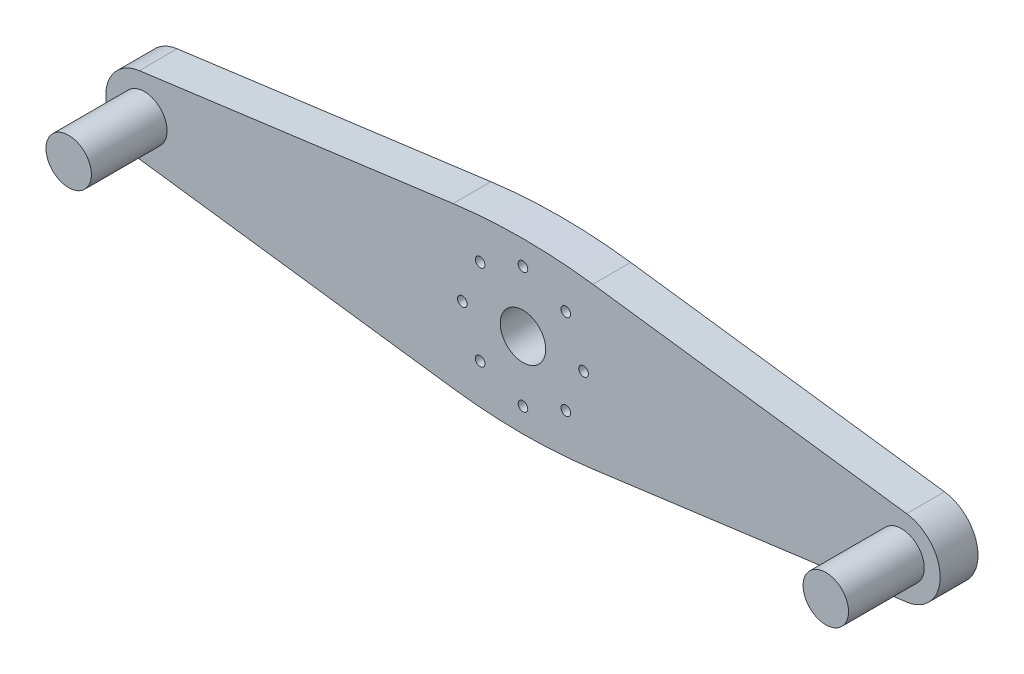
ISO-10303-21;
HEADER;
FILE_DESCRIPTION(('STEP AP214'),'2;1');
FILE_NAME('part.step','',(''),(''),'','','');
FILE_SCHEMA(('AUTOMOTIVE_DESIGN { 1 0 10303 214 1 1 1 1 }'));
ENDSEC;
DATA;
#1=APPLICATION_CONTEXT('core data for automotive mechanical design processes');
#2=APPLICATION_PROTOCOL_DEFINITION('international standard','automotive_design',2000,#1);
#3=PRODUCT_CONTEXT('',#1,'mechanical');
#4=PRODUCT('Part','Part','',(#3));
#5=PRODUCT_RELATED_PRODUCT_CATEGORY('part','',(#4));
#6=PRODUCT_DEFINITION_FORMATION('','',#4);
#7=PRODUCT_DEFINITION_CONTEXT('part definition',#1,'design');
#8=PRODUCT_DEFINITION('design','',#6,#7);
#9=PRODUCT_DEFINITION_SHAPE('','',#8);
#10=(LENGTH_UNIT() NAMED_UNIT(*) SI_UNIT(.MILLI.,.METRE.));
#11=(NAMED_UNIT(*) PLANE_ANGLE_UNIT() SI_UNIT($,.RADIAN.));
#12=(NAMED_UNIT(*) SI_UNIT($,.STERADIAN.) SOLID_ANGLE_UNIT());
#13=UNCERTAINTY_MEASURE_WITH_UNIT(LENGTH_MEASURE(1.E-05),#10,'distance_accuracy_value','');
#14=(GEOMETRIC_REPRESENTATION_CONTEXT(3) GLOBAL_UNCERTAINTY_ASSIGNED_CONTEXT((#13)) GLOBAL_UNIT_ASSIGNED_CONTEXT((#10,
#11,#12)) REPRESENTATION_CONTEXT('',''));
#15=CARTESIAN_POINT('',(0.,0.,0.));
#16=DIRECTION('',(0.,0.,1.));
#17=DIRECTION('',(1.,0.,0.));
#18=AXIS2_PLACEMENT_3D('',#15,#16,#17);
#19=CARTESIAN_POINT('',(50.,0.,5.));
#20=DIRECTION('',(0.,0.,-1.));
#21=DIRECTION('',(-1.,0.,0.));
#22=AXIS2_PLACEMENT_3D('',#19,#20,#21);
#23=PLANE('',#22);
#24=CARTESIAN_POINT('',(50.,0.,5.));
#25=DIRECTION('',(0.,0.,1.));
#26=DIRECTION('',(-1.,0.,0.));
#27=AXIS2_PLACEMENT_3D('',#24,#25,#26);
#28=CIRCLE('',#27,5.10024633771241);
#29=CARTESIAN_POINT('',(50.6728763500851,-5.05566515137672,5.));
#30=VERTEX_POINT('',#29);
#31=CARTESIAN_POINT('',(50.6728763500851,5.05566515137672,5.));
#32=VERTEX_POINT('',#31);
#33=EDGE_CURVE('E154',#30,#32,#28,.T.);
#34=ORIENTED_EDGE('',*,*,#33,.T.);
#35=DIRECTION('',(-0.991259013117456,0.131930166805804,0.));
#36=VECTOR('',#35,1.);
#37=CARTESIAN_POINT('',(50.6728763500851,5.05566515137672,5.));
#38=LINE('',#37,#36);
#39=CARTESIAN_POINT('',(9.2351116764065,10.5707637614413,5.));
#40=VERTEX_POINT('',#39);
#41=EDGE_CURVE('E102',#32,#40,#38,.T.);
#42=ORIENTED_EDGE('',*,*,#41,.T.);
#43=CARTESIAN_POINT('',(0.,-58.8173671567806,5.));
#44=DIRECTION('',(0.,0.,1.));
#45=DIRECTION('',(-1.,0.,0.));
#46=AXIS2_PLACEMENT_3D('',#43,#44,#45);
#47=CIRCLE('',#46,70.);
#48=CARTESIAN_POINT('',(-9.23511167640649,10.5707637614413,5.));
#49=VERTEX_POINT('',#48);
#50=EDGE_CURVE('E169',#40,#49,#47,.T.);
#51=ORIENTED_EDGE('',*,*,#50,.T.);
#52=DIRECTION('',(-0.991259013117456,-0.131930166805804,0.));
#53=VECTOR('',#52,1.);
#54=CARTESIAN_POINT('',(-50.6728763500851,5.05566515137672,5.));
#55=LINE('',#54,#53);
#56=CARTESIAN_POINT('',(-50.6728763500851,5.05566515137672,5.));
#57=VERTEX_POINT('',#56);
#58=EDGE_CURVE('E182',#49,#57,#55,.T.);
#59=ORIENTED_EDGE('',*,*,#58,.T.);
#60=CARTESIAN_POINT('',(-50.,0.,5.));
#61=DIRECTION('',(0.,0.,1.));
#62=DIRECTION('',(1.,0.,0.));
#63=AXIS2_PLACEMENT_3D('',#60,#61,#62);
#64=CIRCLE('',#63,5.10024633771241);
#65=CARTESIAN_POINT('',(-50.6728763500851,-5.05566515137672,5.));
#66=VERTEX_POINT('',#65);
#67=EDGE_CURVE('E121',#57,#66,#64,.T.);
#68=ORIENTED_EDGE('',*,*,#67,.T.);
#69=DIRECTION('',(0.991259013117456,-0.131930166805804,0.));
#70=VECTOR('',#69,1.);
#71=CARTESIAN_POINT('',(-50.6728763500851,-5.05566515137672,5.));
#72=LINE('',#71,#70);
#73=CARTESIAN_POINT('',(-9.23511167640653,-10.5707637614413,5.));
#74=VERTEX_POINT('',#73);
#75=EDGE_CURVE('E115',#66,#74,#72,.T.);
#76=ORIENTED_EDGE('',*,*,#75,.T.);
#77=CARTESIAN_POINT('',(0.,58.8173671567806,5.));
#78=DIRECTION('',(0.,0.,1.));
#79=DIRECTION('',(1.,0.,0.));
#80=AXIS2_PLACEMENT_3D('',#77,#78,#79);
#81=CIRCLE('',#80,70.);
#82=CARTESIAN_POINT('',(9.23511167640649,-10.5707637614413,5.));
#83=VERTEX_POINT('',#82);
#84=EDGE_CURVE('E119',#74,#83,#81,.T.);
#85=ORIENTED_EDGE('',*,*,#84,.T.);
#86=DIRECTION('',(0.991259013117456,0.131930166805804,0.));
#87=VECTOR('',#86,1.);
#88=CARTESIAN_POINT('',(50.6728763500851,-5.05566515137672,5.));
#89=LINE('',#88,#87);
#90=EDGE_CURVE('E59',#83,#30,#89,.T.);
#91=ORIENTED_EDGE('',*,*,#90,.T.);
#92=EDGE_LOOP('',(#34,#42,#51,#59,#68,#76,#85,#91));
#93=FACE_BOUND('',#92,.T.);
#94=CARTESIAN_POINT('',(0.,0.,5.));
#95=DIRECTION('',(0.,0.,1.));
#96=DIRECTION('',(1.,0.,0.));
#97=AXIS2_PLACEMENT_3D('',#94,#95,#96);
#98=CIRCLE('',#97,3.);
#99=CARTESIAN_POINT('',(3.,0.,5.));
#100=VERTEX_POINT('',#99);
#101=EDGE_CURVE('E143',#100,#100,#98,.T.);
#102=ORIENTED_EDGE('',*,*,#101,.F.);
#103=EDGE_LOOP('',(#102));
#104=FACE_BOUND('',#103,.T.);
#105=CARTESIAN_POINT('',(-8.,0.,5.));
#106=DIRECTION('',(0.,0.,1.));
#107=DIRECTION('',(1.,0.,0.));
#108=AXIS2_PLACEMENT_3D('',#105,#106,#107);
#109=CIRCLE('',#108,0.635000000000001);
#110=CARTESIAN_POINT('',(-7.365,0.,5.));
#111=VERTEX_POINT('',#110);
#112=EDGE_CURVE('E191',#111,#111,#109,.T.);
#113=ORIENTED_EDGE('',*,*,#112,.F.);
#114=EDGE_LOOP('',(#113));
#115=FACE_BOUND('',#114,.T.);
#116=CARTESIAN_POINT('',(-50.,0.,5.));
#117=DIRECTION('',(0.,0.,1.));
#118=DIRECTION('',(1.,0.,0.));
#119=AXIS2_PLACEMENT_3D('',#116,#117,#118);
#120=CIRCLE('',#119,3.);
#121=CARTESIAN_POINT('',(-47.,0.,5.));
#122=VERTEX_POINT('',#121);
#123=EDGE_CURVE('E197',#122,#122,#120,.T.);
#124=ORIENTED_EDGE('',*,*,#123,.F.);
#125=EDGE_LOOP('',(#124));
#126=FACE_BOUND('',#125,.T.);
#127=CARTESIAN_POINT('',(-5.65685424949237,5.65685424949239,5.));
#128=DIRECTION('',(0.,0.,1.));
#129=DIRECTION('',(1.,0.,0.));
#130=AXIS2_PLACEMENT_3D('',#127,#128,#129);
#131=CIRCLE('',#130,0.635000000000001);
#132=CARTESIAN_POINT('',(-5.02185424949237,5.65685424949239,5.));
#133=VERTEX_POINT('',#132);
#134=EDGE_CURVE('E202',#133,#133,#131,.T.);
#135=ORIENTED_EDGE('',*,*,#134,.F.);
#136=EDGE_LOOP('',(#135));
#137=FACE_BOUND('',#136,.T.);
#138=CARTESIAN_POINT('',(0.,8.,5.));
#139=DIRECTION('',(0.,0.,1.));
#140=DIRECTION('',(1.,0.,0.));
#141=AXIS2_PLACEMENT_3D('',#138,#139,#140);
#142=CIRCLE('',#141,0.635000000000001);
#143=CARTESIAN_POINT('',(0.63500000000003,8.,5.));
#144=VERTEX_POINT('',#143);
#145=EDGE_CURVE('E206',#144,#144,#142,.T.);
#146=ORIENTED_EDGE('',*,*,#145,.F.);
#147=EDGE_LOOP('',(#146));
#148=FACE_BOUND('',#147,.T.);
#149=CARTESIAN_POINT('',(50.,0.,5.));
#150=DIRECTION('',(0.,0.,1.));
#151=DIRECTION('',(-1.,0.,0.));
#152=AXIS2_PLACEMENT_3D('',#149,#150,#151);
#153=CIRCLE('',#152,3.);
#154=CARTESIAN_POINT('',(47.,0.,5.));
#155=VERTEX_POINT('',#154);
#156=EDGE_CURVE('E212',#155,#155,#153,.T.);
#157=ORIENTED_EDGE('',*,*,#156,.F.);
#158=EDGE_LOOP('',(#157));
#159=FACE_BOUND('',#158,.T.);
#160=CARTESIAN_POINT('',(5.65685424949241,5.65685424949235,5.));
#161=DIRECTION('',(0.,0.,1.));
#162=DIRECTION('',(1.,0.,0.));
#163=AXIS2_PLACEMENT_3D('',#160,#161,#162);
#164=CIRCLE('',#163,0.635);
#165=CARTESIAN_POINT('',(6.29185424949241,5.65685424949235,5.));
#166=VERTEX_POINT('',#165);
#167=EDGE_CURVE('E217',#166,#166,#164,.T.);
#168=ORIENTED_EDGE('',*,*,#167,.F.);
#169=EDGE_LOOP('',(#168));
#170=FACE_BOUND('',#169,.T.);
#171=CARTESIAN_POINT('',(8.,0.,5.));
#172=DIRECTION('',(0.,0.,1.));
#173=DIRECTION('',(1.,0.,0.));
#174=AXIS2_PLACEMENT_3D('',#171,#172,#173);
#175=CIRCLE('',#174,0.635);
#176=CARTESIAN_POINT('',(8.635,0.,5.));
#177=VERTEX_POINT('',#176);
#178=EDGE_CURVE('E221',#177,#177,#175,.T.);
#179=ORIENTED_EDGE('',*,*,#178,.F.);
#180=EDGE_LOOP('',(#179));
#181=FACE_BOUND('',#180,.T.);
#182=CARTESIAN_POINT('',(5.65685424949233,-5.65685424949243,5.));
#183=DIRECTION('',(0.,0.,1.));
#184=DIRECTION('',(1.,0.,0.));
#185=AXIS2_PLACEMENT_3D('',#182,#183,#184);
#186=CIRCLE('',#185,0.635000000000001);
#187=CARTESIAN_POINT('',(6.29185424949233,-5.65685424949243,5.));
#188=VERTEX_POINT('',#187);
#189=EDGE_CURVE('E227',#188,#188,#186,.T.);
#190=ORIENTED_EDGE('',*,*,#189,.F.);
#191=EDGE_LOOP('',(#190));
#192=FACE_BOUND('',#191,.T.);
#193=CARTESIAN_POINT('',(0.,-8.,5.));
#194=DIRECTION('',(0.,0.,1.));
#195=DIRECTION('',(1.,0.,0.));
#196=AXIS2_PLACEMENT_3D('',#193,#194,#195);
#197=CIRCLE('',#196,0.635);
#198=CARTESIAN_POINT('',(0.634999999999915,-8.,5.));
#199=VERTEX_POINT('',#198);
#200=EDGE_CURVE('E233',#199,#199,#197,.T.);
#201=ORIENTED_EDGE('',*,*,#200,.F.);
#202=EDGE_LOOP('',(#201));
#203=FACE_BOUND('',#202,.T.);
#204=CARTESIAN_POINT('',(-5.65685424949245,-5.65685424949231,5.));
#205=DIRECTION('',(0.,0.,1.));
#206=DIRECTION('',(1.,0.,0.));
#207=AXIS2_PLACEMENT_3D('',#204,#205,#206);
#208=CIRCLE('',#207,0.635);
#209=CARTESIAN_POINT('',(-5.02185424949245,-5.65685424949231,5.));
#210=VERTEX_POINT('',#209);
#211=EDGE_CURVE('E239',#210,#210,#208,.T.);
#212=ORIENTED_EDGE('',*,*,#211,.F.);
#213=EDGE_LOOP('',(#212));
#214=FACE_BOUND('',#213,.T.);
#215=ADVANCED_FACE('F42',(#93,#104,#115,#126,#137,#148,#159,#170,#181,#192,#203,#214),#23,.F.);
#216=CARTESIAN_POINT('',(50.,0.,0.));
#217=DIRECTION('',(0.,0.,-1.));
#218=DIRECTION('',(-1.,0.,0.));
#219=AXIS2_PLACEMENT_3D('',#216,#217,#218);
#220=PLANE('',#219);
#221=CARTESIAN_POINT('',(0.,-8.,0.));
#222=DIRECTION('',(0.,0.,1.));
#223=DIRECTION('',(1.,0.,0.));
#224=AXIS2_PLACEMENT_3D('',#221,#222,#223);
#225=CIRCLE('',#224,0.635);
#226=CARTESIAN_POINT('',(0.634999999999915,-8.,0.));
#227=VERTEX_POINT('',#226);
#228=EDGE_CURVE('E236',#227,#227,#225,.T.);
#229=ORIENTED_EDGE('',*,*,#228,.T.);
#230=EDGE_LOOP('',(#229));
#231=FACE_BOUND('',#230,.T.);
#232=CARTESIAN_POINT('',(8.,0.,0.));
#233=DIRECTION('',(0.,0.,1.));
#234=DIRECTION('',(1.,0.,0.));
#235=AXIS2_PLACEMENT_3D('',#232,#233,#234);
#236=CIRCLE('',#235,0.635);
#237=CARTESIAN_POINT('',(8.635,0.,0.));
#238=VERTEX_POINT('',#237);
#239=EDGE_CURVE('E224',#238,#238,#236,.T.);
#240=ORIENTED_EDGE('',*,*,#239,.T.);
#241=EDGE_LOOP('',(#240));
#242=FACE_BOUND('',#241,.T.);
#243=CARTESIAN_POINT('',(-5.65685424949237,5.65685424949239,0.));
#244=DIRECTION('',(0.,0.,1.));
#245=DIRECTION('',(1.,0.,0.));
#246=AXIS2_PLACEMENT_3D('',#243,#244,#245);
#247=CIRCLE('',#246,0.635000000000001);
#248=CARTESIAN_POINT('',(-5.02185424949237,5.65685424949239,0.));
#249=VERTEX_POINT('',#248);
#250=EDGE_CURVE('E203',#249,#249,#247,.T.);
#251=ORIENTED_EDGE('',*,*,#250,.T.);
#252=EDGE_LOOP('',(#251));
#253=FACE_BOUND('',#252,.T.);
#254=CARTESIAN_POINT('',(-8.,0.,0.));
#255=DIRECTION('',(0.,0.,1.));
#256=DIRECTION('',(1.,0.,0.));
#257=AXIS2_PLACEMENT_3D('',#254,#255,#256);
#258=CIRCLE('',#257,0.635000000000001);
#259=CARTESIAN_POINT('',(-7.365,0.,0.));
#260=VERTEX_POINT('',#259);
#261=EDGE_CURVE('E194',#260,#260,#258,.T.);
#262=ORIENTED_EDGE('',*,*,#261,.T.);
#263=EDGE_LOOP('',(#262));
#264=FACE_BOUND('',#263,.T.);
#265=CARTESIAN_POINT('',(50.,0.,0.));
#266=DIRECTION('',(0.,0.,1.));
#267=DIRECTION('',(-1.,0.,0.));
#268=AXIS2_PLACEMENT_3D('',#265,#266,#267);
#269=CIRCLE('',#268,5.10024633771241);
#270=CARTESIAN_POINT('',(50.6728763500851,-5.05566515137672,0.));
#271=VERTEX_POINT('',#270);
#272=CARTESIAN_POINT('',(50.6728763500851,5.05566515137672,0.));
#273=VERTEX_POINT('',#272);
#274=EDGE_CURVE('E139',#271,#273,#269,.T.);
#275=ORIENTED_EDGE('',*,*,#274,.F.);
#276=DIRECTION('',(0.991259013117456,0.131930166805804,0.));
#277=VECTOR('',#276,1.);
#278=CARTESIAN_POINT('',(50.6728763500851,-5.05566515137672,0.));
#279=LINE('',#278,#277);
#280=CARTESIAN_POINT('',(9.23511167640649,-10.5707637614413,0.));
#281=VERTEX_POINT('',#280);
#282=EDGE_CURVE('E94',#281,#271,#279,.T.);
#283=ORIENTED_EDGE('',*,*,#282,.F.);
#284=CARTESIAN_POINT('',(0.,58.8173671567806,0.));
#285=DIRECTION('',(0.,0.,1.));
#286=DIRECTION('',(1.,0.,0.));
#287=AXIS2_PLACEMENT_3D('',#284,#285,#286);
#288=CIRCLE('',#287,70.);
#289=CARTESIAN_POINT('',(-9.23511167640653,-10.5707637614413,0.));
#290=VERTEX_POINT('',#289);
#291=EDGE_CURVE('E88',#290,#281,#288,.T.);
#292=ORIENTED_EDGE('',*,*,#291,.F.);
#293=DIRECTION('',(0.991259013117456,-0.131930166805804,0.));
#294=VECTOR('',#293,1.);
#295=CARTESIAN_POINT('',(-50.6728763500851,-5.05566515137672,0.));
#296=LINE('',#295,#294);
#297=CARTESIAN_POINT('',(-50.6728763500851,-5.05566515137672,0.));
#298=VERTEX_POINT('',#297);
#299=EDGE_CURVE('E129',#298,#290,#296,.T.);
#300=ORIENTED_EDGE('',*,*,#299,.F.);
#301=CARTESIAN_POINT('',(-50.,0.,0.));
#302=DIRECTION('',(0.,0.,1.));
#303=DIRECTION('',(1.,0.,0.));
#304=AXIS2_PLACEMENT_3D('',#301,#302,#303);
#305=CIRCLE('',#304,5.10024633771241);
#306=CARTESIAN_POINT('',(-50.6728763500851,5.05566515137672,0.));
#307=VERTEX_POINT('',#306);
#308=EDGE_CURVE('E149',#307,#298,#305,.T.);
#309=ORIENTED_EDGE('',*,*,#308,.F.);
#310=DIRECTION('',(-0.991259013117456,-0.131930166805804,0.));
#311=VECTOR('',#310,1.);
#312=CARTESIAN_POINT('',(-50.6728763500851,5.05566515137672,0.));
#313=LINE('',#312,#311);
#314=CARTESIAN_POINT('',(-9.23511167640649,10.5707637614413,0.));
#315=VERTEX_POINT('',#314);
#316=EDGE_CURVE('E147',#315,#307,#313,.T.);
#317=ORIENTED_EDGE('',*,*,#316,.F.);
#318=CARTESIAN_POINT('',(0.,-58.8173671567806,0.));
#319=DIRECTION('',(0.,0.,1.));
#320=DIRECTION('',(-1.,0.,0.));
#321=AXIS2_PLACEMENT_3D('',#318,#319,#320);
#322=CIRCLE('',#321,70.);
#323=CARTESIAN_POINT('',(9.2351116764065,10.5707637614413,0.));
#324=VERTEX_POINT('',#323);
#325=EDGE_CURVE('E145',#324,#315,#322,.T.);
#326=ORIENTED_EDGE('',*,*,#325,.F.);
#327=DIRECTION('',(-0.991259013117456,0.131930166805804,0.));
#328=VECTOR('',#327,1.);
#329=CARTESIAN_POINT('',(50.6728763500851,5.05566515137672,0.));
#330=LINE('',#329,#328);
#331=EDGE_CURVE('E142',#273,#324,#330,.T.);
#332=ORIENTED_EDGE('',*,*,#331,.F.);
#333=EDGE_LOOP('',(#275,#283,#292,#300,#309,#317,#326,#332));
#334=FACE_BOUND('',#333,.T.);
#335=CARTESIAN_POINT('',(0.,0.,0.));
#336=DIRECTION('',(0.,0.,1.));
#337=DIRECTION('',(1.,0.,0.));
#338=AXIS2_PLACEMENT_3D('',#335,#336,#337);
#339=CIRCLE('',#338,3.);
#340=CARTESIAN_POINT('',(3.,0.,0.));
#341=VERTEX_POINT('',#340);
#342=EDGE_CURVE('E188',#341,#341,#339,.T.);
#343=ORIENTED_EDGE('',*,*,#342,.T.);
#344=EDGE_LOOP('',(#343));
#345=FACE_BOUND('',#344,.T.);
#346=CARTESIAN_POINT('',(0.,8.,0.));
#347=DIRECTION('',(0.,0.,1.));
#348=DIRECTION('',(1.,0.,0.));
#349=AXIS2_PLACEMENT_3D('',#346,#347,#348);
#350=CIRCLE('',#349,0.635000000000001);
#351=CARTESIAN_POINT('',(0.63500000000003,8.,0.));
#352=VERTEX_POINT('',#351);
#353=EDGE_CURVE('E209',#352,#352,#350,.T.);
#354=ORIENTED_EDGE('',*,*,#353,.T.);
#355=EDGE_LOOP('',(#354));
#356=FACE_BOUND('',#355,.T.);
#357=CARTESIAN_POINT('',(5.65685424949241,5.65685424949235,0.));
#358=DIRECTION('',(0.,0.,1.));
#359=DIRECTION('',(1.,0.,0.));
#360=AXIS2_PLACEMENT_3D('',#357,#358,#359);
#361=CIRCLE('',#360,0.635);
#362=CARTESIAN_POINT('',(6.29185424949241,5.65685424949235,0.));
#363=VERTEX_POINT('',#362);
#364=EDGE_CURVE('E218',#363,#363,#361,.T.);
#365=ORIENTED_EDGE('',*,*,#364,.T.);
#366=EDGE_LOOP('',(#365));
#367=FACE_BOUND('',#366,.T.);
#368=CARTESIAN_POINT('',(5.65685424949233,-5.65685424949243,0.));
#369=DIRECTION('',(0.,0.,1.));
#370=DIRECTION('',(1.,0.,0.));
#371=AXIS2_PLACEMENT_3D('',#368,#369,#370);
#372=CIRCLE('',#371,0.635000000000001);
#373=CARTESIAN_POINT('',(6.29185424949233,-5.65685424949243,0.));
#374=VERTEX_POINT('',#373);
#375=EDGE_CURVE('E230',#374,#374,#372,.T.);
#376=ORIENTED_EDGE('',*,*,#375,.T.);
#377=EDGE_LOOP('',(#376));
#378=FACE_BOUND('',#377,.T.);
#379=CARTESIAN_POINT('',(-5.65685424949245,-5.65685424949231,0.));
#380=DIRECTION('',(0.,0.,1.));
#381=DIRECTION('',(1.,0.,0.));
#382=AXIS2_PLACEMENT_3D('',#379,#380,#381);
#383=CIRCLE('',#382,0.635);
#384=CARTESIAN_POINT('',(-5.02185424949245,-5.65685424949231,0.));
#385=VERTEX_POINT('',#384);
#386=EDGE_CURVE('E242',#385,#385,#383,.T.);
#387=ORIENTED_EDGE('',*,*,#386,.T.);
#388=EDGE_LOOP('',(#387));
#389=FACE_BOUND('',#388,.T.);
#390=ADVANCED_FACE('F173',(#231,#242,#253,#264,#334,#345,#356,#367,#378,#389),#220,.T.);
#391=CARTESIAN_POINT('',(50.,0.,5.));
#392=DIRECTION('',(0.,0.,-1.));
#393=DIRECTION('',(-1.,0.,0.));
#394=AXIS2_PLACEMENT_3D('',#391,#392,#393);
#395=CYLINDRICAL_SURFACE('',#394,5.10024633771241);
#396=ORIENTED_EDGE('',*,*,#274,.T.);
#397=DIRECTION('',(0.,0.,-1.));
#398=VECTOR('',#397,1.);
#399=CARTESIAN_POINT('',(50.6728763500851,5.05566515137672,5.));
#400=LINE('',#399,#398);
#401=EDGE_CURVE('E11',#32,#273,#400,.T.);
#402=ORIENTED_EDGE('',*,*,#401,.F.);
#403=ORIENTED_EDGE('',*,*,#33,.F.);
#404=DIRECTION('',(0.,0.,-1.));
#405=VECTOR('',#404,1.);
#406=CARTESIAN_POINT('',(50.6728763500851,-5.05566515137672,5.));
#407=LINE('',#406,#405);
#408=EDGE_CURVE('E135',#30,#271,#407,.T.);
#409=ORIENTED_EDGE('',*,*,#408,.T.);
#410=EDGE_LOOP('',(#396,#402,#403,#409));
#411=FACE_BOUND('',#410,.T.);
#412=ADVANCED_FACE('F44',(#411),#395,.T.);
#413=CARTESIAN_POINT('',(50.6728763500851,5.05566515137672,5.));
#414=DIRECTION('',(-0.131930166805804,-0.991259013117456,0.));
#415=DIRECTION('',(0.991259013117456,-0.131930166805804,0.));
#416=AXIS2_PLACEMENT_3D('',#413,#414,#415);
#417=PLANE('',#416);
#418=ORIENTED_EDGE('',*,*,#331,.T.);
#419=DIRECTION('',(0.,0.,-1.));
#420=VECTOR('',#419,1.);
#421=CARTESIAN_POINT('',(9.2351116764065,10.5707637614413,5.));
#422=LINE('',#421,#420);
#423=EDGE_CURVE('E51',#40,#324,#422,.T.);
#424=ORIENTED_EDGE('',*,*,#423,.F.);
#425=ORIENTED_EDGE('',*,*,#41,.F.);
#426=ORIENTED_EDGE('',*,*,#401,.T.);
#427=EDGE_LOOP('',(#418,#424,#425,#426));
#428=FACE_BOUND('',#427,.T.);
#429=ADVANCED_FACE('F288',(#428),#417,.F.);
#430=CARTESIAN_POINT('',(0.,-58.8173671567806,5.));
#431=DIRECTION('',(0.,0.,-1.));
#432=DIRECTION('',(-1.,0.,0.));
#433=AXIS2_PLACEMENT_3D('',#430,#431,#432);
#434=CYLINDRICAL_SURFACE('',#433,70.);
#435=ORIENTED_EDGE('',*,*,#325,.T.);
#436=DIRECTION('',(0.,0.,-1.));
#437=VECTOR('',#436,1.);
#438=CARTESIAN_POINT('',(-9.23511167640649,10.5707637614413,5.));
#439=LINE('',#438,#437);
#440=EDGE_CURVE('E161',#49,#315,#439,.T.);
#441=ORIENTED_EDGE('',*,*,#440,.F.);
#442=ORIENTED_EDGE('',*,*,#50,.F.);
#443=ORIENTED_EDGE('',*,*,#423,.T.);
#444=EDGE_LOOP('',(#435,#441,#442,#443));
#445=FACE_BOUND('',#444,.T.);
#446=ADVANCED_FACE('F167',(#445),#434,.T.);
#447=CARTESIAN_POINT('',(-50.6728763500851,5.05566515137672,5.));
#448=DIRECTION('',(0.131930166805804,-0.991259013117456,0.));
#449=DIRECTION('',(0.991259013117456,0.131930166805804,0.));
#450=AXIS2_PLACEMENT_3D('',#447,#448,#449);
#451=PLANE('',#450);
#452=ORIENTED_EDGE('',*,*,#316,.T.);
#453=DIRECTION('',(0.,0.,-1.));
#454=VECTOR('',#453,1.);
#455=CARTESIAN_POINT('',(-50.6728763500851,5.05566515137672,5.));
#456=LINE('',#455,#454);
#457=EDGE_CURVE('E158',#57,#307,#456,.T.);
#458=ORIENTED_EDGE('',*,*,#457,.F.);
#459=ORIENTED_EDGE('',*,*,#58,.F.);
#460=ORIENTED_EDGE('',*,*,#440,.T.);
#461=EDGE_LOOP('',(#452,#458,#459,#460));
#462=FACE_BOUND('',#461,.T.);
#463=ADVANCED_FACE('F178',(#462),#451,.F.);
#464=CARTESIAN_POINT('',(-50.,0.,5.));
#465=DIRECTION('',(0.,0.,-1.));
#466=DIRECTION('',(-1.,0.,0.));
#467=AXIS2_PLACEMENT_3D('',#464,#465,#466);
#468=CYLINDRICAL_SURFACE('',#467,5.10024633771241);
#469=ORIENTED_EDGE('',*,*,#308,.T.);
#470=DIRECTION('',(0.,0.,-1.));
#471=VECTOR('',#470,1.);
#472=CARTESIAN_POINT('',(-50.6728763500851,-5.05566515137672,5.));
#473=LINE('',#472,#471);
#474=EDGE_CURVE('E130',#66,#298,#473,.T.);
#475=ORIENTED_EDGE('',*,*,#474,.F.);
#476=ORIENTED_EDGE('',*,*,#67,.F.);
#477=ORIENTED_EDGE('',*,*,#457,.T.);
#478=EDGE_LOOP('',(#469,#475,#476,#477));
#479=FACE_BOUND('',#478,.T.);
#480=ADVANCED_FACE('F181',(#479),#468,.T.);
#481=CARTESIAN_POINT('',(-50.6728763500851,-5.05566515137672,5.));
#482=DIRECTION('',(0.131930166805804,0.991259013117456,0.));
#483=DIRECTION('',(-0.991259013117456,0.131930166805804,0.));
#484=AXIS2_PLACEMENT_3D('',#481,#482,#483);
#485=PLANE('',#484);
#486=ORIENTED_EDGE('',*,*,#299,.T.);
#487=DIRECTION('',(0.,0.,-1.));
#488=VECTOR('',#487,1.);
#489=CARTESIAN_POINT('',(-9.23511167640653,-10.5707637614413,5.));
#490=LINE('',#489,#488);
#491=EDGE_CURVE('E126',#74,#290,#490,.T.);
#492=ORIENTED_EDGE('',*,*,#491,.F.);
#493=ORIENTED_EDGE('',*,*,#75,.F.);
#494=ORIENTED_EDGE('',*,*,#474,.T.);
#495=EDGE_LOOP('',(#486,#492,#493,#494));
#496=FACE_BOUND('',#495,.T.);
#497=ADVANCED_FACE('F127',(#496),#485,.F.);
#498=CARTESIAN_POINT('',(0.,58.8173671567806,5.));
#499=DIRECTION('',(0.,0.,-1.));
#500=DIRECTION('',(-1.,0.,0.));
#501=AXIS2_PLACEMENT_3D('',#498,#499,#500);
#502=CYLINDRICAL_SURFACE('',#501,70.);
#503=ORIENTED_EDGE('',*,*,#291,.T.);
#504=DIRECTION('',(0.,0.,-1.));
#505=VECTOR('',#504,1.);
#506=CARTESIAN_POINT('',(9.23511167640649,-10.5707637614413,5.));
#507=LINE('',#506,#505);
#508=EDGE_CURVE('E131',#83,#281,#507,.T.);
#509=ORIENTED_EDGE('',*,*,#508,.F.);
#510=ORIENTED_EDGE('',*,*,#84,.F.);
#511=ORIENTED_EDGE('',*,*,#491,.T.);
#512=EDGE_LOOP('',(#503,#509,#510,#511));
#513=FACE_BOUND('',#512,.T.);
#514=ADVANCED_FACE('F133',(#513),#502,.T.);
#515=CARTESIAN_POINT('',(50.6728763500851,-5.05566515137672,5.));
#516=DIRECTION('',(-0.131930166805804,0.991259013117456,0.));
#517=DIRECTION('',(-0.991259013117456,-0.131930166805804,0.));
#518=AXIS2_PLACEMENT_3D('',#515,#516,#517);
#519=PLANE('',#518);
#520=ORIENTED_EDGE('',*,*,#282,.T.);
#521=ORIENTED_EDGE('',*,*,#408,.F.);
#522=ORIENTED_EDGE('',*,*,#90,.F.);
#523=ORIENTED_EDGE('',*,*,#508,.T.);
#524=EDGE_LOOP('',(#520,#521,#522,#523));
#525=FACE_BOUND('',#524,.T.);
#526=ADVANCED_FACE('F276',(#525),#519,.F.);
#527=CARTESIAN_POINT('',(0.,0.,5.));
#528=DIRECTION('',(0.,0.,-1.));
#529=DIRECTION('',(-1.,0.,0.));
#530=AXIS2_PLACEMENT_3D('',#527,#528,#529);
#531=CYLINDRICAL_SURFACE('',#530,3.);
#532=ORIENTED_EDGE('',*,*,#101,.T.);
#533=EDGE_LOOP('',(#532));
#534=FACE_BOUND('',#533,.T.);
#535=ORIENTED_EDGE('',*,*,#342,.F.);
#536=EDGE_LOOP('',(#535));
#537=FACE_BOUND('',#536,.T.);
#538=ADVANCED_FACE('F273',(#534,#537),#531,.F.);
#539=CARTESIAN_POINT('',(-8.,0.,5.));
#540=DIRECTION('',(0.,0.,-1.));
#541=DIRECTION('',(-1.,0.,0.));
#542=AXIS2_PLACEMENT_3D('',#539,#540,#541);
#543=CYLINDRICAL_SURFACE('',#542,0.635000000000001);
#544=ORIENTED_EDGE('',*,*,#112,.T.);
#545=EDGE_LOOP('',(#544));
#546=FACE_BOUND('',#545,.T.);
#547=ORIENTED_EDGE('',*,*,#261,.F.);
#548=EDGE_LOOP('',(#547));
#549=FACE_BOUND('',#548,.T.);
#550=ADVANCED_FACE('F367',(#546,#549),#543,.F.);
#551=CARTESIAN_POINT('',(-5.65685424949237,5.65685424949239,5.));
#552=DIRECTION('',(0.,0.,-1.));
#553=DIRECTION('',(-1.,0.,0.));
#554=AXIS2_PLACEMENT_3D('',#551,#552,#553);
#555=CYLINDRICAL_SURFACE('',#554,0.635000000000001);
#556=ORIENTED_EDGE('',*,*,#134,.T.);
#557=EDGE_LOOP('',(#556));
#558=FACE_BOUND('',#557,.T.);
#559=ORIENTED_EDGE('',*,*,#250,.F.);
#560=EDGE_LOOP('',(#559));
#561=FACE_BOUND('',#560,.T.);
#562=ADVANCED_FACE('F364',(#558,#561),#555,.F.);
#563=CARTESIAN_POINT('',(0.,8.,5.));
#564=DIRECTION('',(0.,0.,-1.));
#565=DIRECTION('',(-1.,0.,0.));
#566=AXIS2_PLACEMENT_3D('',#563,#564,#565);
#567=CYLINDRICAL_SURFACE('',#566,0.635000000000001);
#568=ORIENTED_EDGE('',*,*,#145,.T.);
#569=EDGE_LOOP('',(#568));
#570=FACE_BOUND('',#569,.T.);
#571=ORIENTED_EDGE('',*,*,#353,.F.);
#572=EDGE_LOOP('',(#571));
#573=FACE_BOUND('',#572,.T.);
#574=ADVANCED_FACE('F360',(#570,#573),#567,.F.);
#575=CARTESIAN_POINT('',(5.65685424949241,5.65685424949235,5.));
#576=DIRECTION('',(0.,0.,-1.));
#577=DIRECTION('',(-1.,0.,0.));
#578=AXIS2_PLACEMENT_3D('',#575,#576,#577);
#579=CYLINDRICAL_SURFACE('',#578,0.635);
#580=ORIENTED_EDGE('',*,*,#167,.T.);
#581=EDGE_LOOP('',(#580));
#582=FACE_BOUND('',#581,.T.);
#583=ORIENTED_EDGE('',*,*,#364,.F.);
#584=EDGE_LOOP('',(#583));
#585=FACE_BOUND('',#584,.T.);
#586=ADVANCED_FACE('F356',(#582,#585),#579,.F.);
#587=CARTESIAN_POINT('',(8.,0.,5.));
#588=DIRECTION('',(0.,0.,-1.));
#589=DIRECTION('',(-1.,0.,0.));
#590=AXIS2_PLACEMENT_3D('',#587,#588,#589);
#591=CYLINDRICAL_SURFACE('',#590,0.635);
#592=ORIENTED_EDGE('',*,*,#178,.T.);
#593=EDGE_LOOP('',(#592));
#594=FACE_BOUND('',#593,.T.);
#595=ORIENTED_EDGE('',*,*,#239,.F.);
#596=EDGE_LOOP('',(#595));
#597=FACE_BOUND('',#596,.T.);
#598=ADVANCED_FACE('F352',(#594,#597),#591,.F.);
#599=CARTESIAN_POINT('',(5.65685424949233,-5.65685424949243,5.));
#600=DIRECTION('',(0.,0.,-1.));
#601=DIRECTION('',(-1.,0.,0.));
#602=AXIS2_PLACEMENT_3D('',#599,#600,#601);
#603=CYLINDRICAL_SURFACE('',#602,0.635000000000001);
#604=ORIENTED_EDGE('',*,*,#189,.T.);
#605=EDGE_LOOP('',(#604));
#606=FACE_BOUND('',#605,.T.);
#607=ORIENTED_EDGE('',*,*,#375,.F.);
#608=EDGE_LOOP('',(#607));
#609=FACE_BOUND('',#608,.T.);
#610=ADVANCED_FACE('F348',(#606,#609),#603,.F.);
#611=CARTESIAN_POINT('',(0.,-8.,5.));
#612=DIRECTION('',(0.,0.,-1.));
#613=DIRECTION('',(-1.,0.,0.));
#614=AXIS2_PLACEMENT_3D('',#611,#612,#613);
#615=CYLINDRICAL_SURFACE('',#614,0.635);
#616=ORIENTED_EDGE('',*,*,#200,.T.);
#617=EDGE_LOOP('',(#616));
#618=FACE_BOUND('',#617,.T.);
#619=ORIENTED_EDGE('',*,*,#228,.F.);
#620=EDGE_LOOP('',(#619));
#621=FACE_BOUND('',#620,.T.);
#622=ADVANCED_FACE('F344',(#618,#621),#615,.F.);
#623=CARTESIAN_POINT('',(-5.65685424949245,-5.65685424949231,5.));
#624=DIRECTION('',(0.,0.,-1.));
#625=DIRECTION('',(-1.,0.,0.));
#626=AXIS2_PLACEMENT_3D('',#623,#624,#625);
#627=CYLINDRICAL_SURFACE('',#626,0.635);
#628=ORIENTED_EDGE('',*,*,#211,.T.);
#629=EDGE_LOOP('',(#628));
#630=FACE_BOUND('',#629,.T.);
#631=ORIENTED_EDGE('',*,*,#386,.F.);
#632=EDGE_LOOP('',(#631));
#633=FACE_BOUND('',#632,.T.);
#634=ADVANCED_FACE('F310',(#630,#633),#627,.F.);
#635=CARTESIAN_POINT('',(-50.,0.,15.));
#636=DIRECTION('',(0.,0.,-1.));
#637=DIRECTION('',(-1.,0.,0.));
#638=AXIS2_PLACEMENT_3D('',#635,#636,#637);
#639=CYLINDRICAL_SURFACE('',#638,3.);
#640=CARTESIAN_POINT('',(-50.,0.,15.));
#641=DIRECTION('',(0.,0.,1.));
#642=DIRECTION('',(1.,0.,0.));
#643=AXIS2_PLACEMENT_3D('',#640,#641,#642);
#644=CIRCLE('',#643,3.);
#645=CARTESIAN_POINT('',(-47.,0.,15.));
#646=VERTEX_POINT('',#645);
#647=EDGE_CURVE('E245',#646,#646,#644,.T.);
#648=ORIENTED_EDGE('',*,*,#647,.F.);
#649=EDGE_LOOP('',(#648));
#650=FACE_BOUND('',#649,.T.);
#651=ORIENTED_EDGE('',*,*,#123,.T.);
#652=EDGE_LOOP('',(#651));
#653=FACE_BOUND('',#652,.T.);
#654=ADVANCED_FACE('F315',(#650,#653),#639,.T.);
#655=CARTESIAN_POINT('',(0.,0.,15.));
#656=DIRECTION('',(0.,0.,1.));
#657=DIRECTION('',(1.,0.,0.));
#658=AXIS2_PLACEMENT_3D('',#655,#656,#657);
#659=PLANE('',#658);
#660=ORIENTED_EDGE('',*,*,#647,.T.);
#661=EDGE_LOOP('',(#660));
#662=FACE_BOUND('',#661,.T.);
#663=ADVANCED_FACE('F263',(#662),#659,.T.);
#664=CARTESIAN_POINT('',(50.,0.,15.));
#665=DIRECTION('',(0.,0.,-1.));
#666=DIRECTION('',(-1.,0.,0.));
#667=AXIS2_PLACEMENT_3D('',#664,#665,#666);
#668=CYLINDRICAL_SURFACE('',#667,3.);
#669=CARTESIAN_POINT('',(50.,0.,15.));
#670=DIRECTION('',(0.,0.,1.));
#671=DIRECTION('',(1.,0.,0.));
#672=AXIS2_PLACEMENT_3D('',#669,#670,#671);
#673=CIRCLE('',#672,3.);
#674=CARTESIAN_POINT('',(53.,0.,15.));
#675=VERTEX_POINT('',#674);
#676=EDGE_CURVE('E250',#675,#675,#673,.F.);
#677=ORIENTED_EDGE('',*,*,#676,.T.);
#678=EDGE_LOOP('',(#677));
#679=FACE_BOUND('',#678,.T.);
#680=ORIENTED_EDGE('',*,*,#156,.T.);
#681=EDGE_LOOP('',(#680));
#682=FACE_BOUND('',#681,.T.);
#683=ADVANCED_FACE('F254',(#679,#682),#668,.T.);
#684=CARTESIAN_POINT('',(0.,0.,15.));
#685=DIRECTION('',(0.,0.,1.));
#686=DIRECTION('',(1.,0.,0.));
#687=AXIS2_PLACEMENT_3D('',#684,#685,#686);
#688=PLANE('',#687);
#689=ORIENTED_EDGE('',*,*,#676,.F.);
#690=EDGE_LOOP('',(#689));
#691=FACE_BOUND('',#690,.T.);
#692=ADVANCED_FACE('F257',(#691),#688,.T.);
#693=CLOSED_SHELL('',(#215,#390,#412,#429,#446,#463,#480,#497,#514,#526,#538,#550,#562,#574,
#586,#598,#610,#622,#634,#654,#663,#683,#692));
#694=MANIFOLD_SOLID_BREP('B2',#693);
#695=ADVANCED_BREP_SHAPE_REPRESENTATION('',(#18,#694),#14);
#696=SHAPE_DEFINITION_REPRESENTATION(#9,#695);
ENDSEC;
END-ISO-10303-21;
